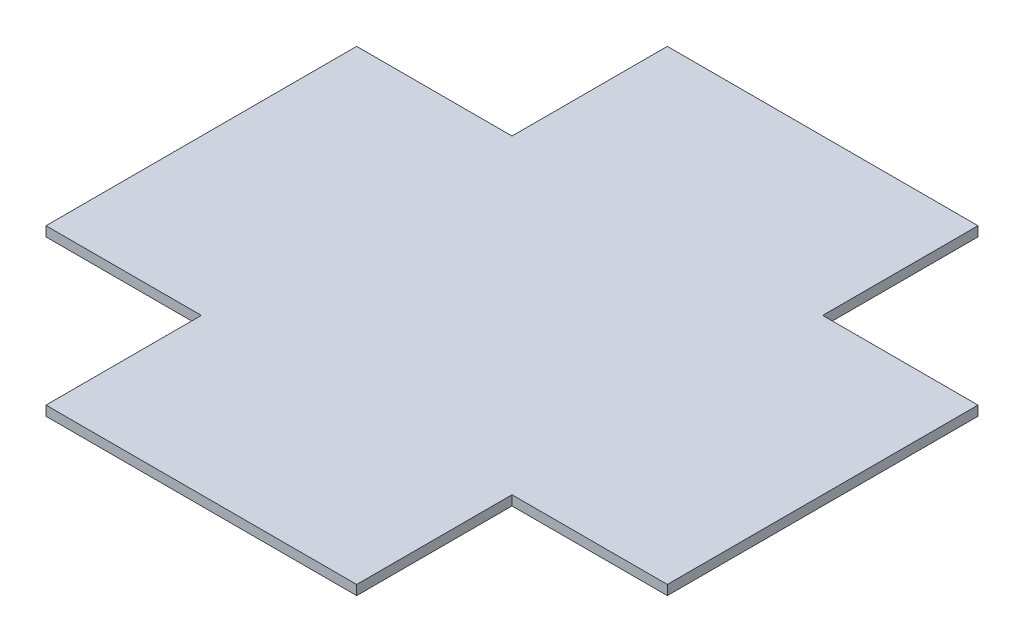
ISO-10303-21;
HEADER;
FILE_DESCRIPTION(('STEP AP214'),'2;1');
FILE_NAME('part.step','',(''),(''),'','','');
FILE_SCHEMA(('AUTOMOTIVE_DESIGN { 1 0 10303 214 1 1 1 1 }'));
ENDSEC;
DATA;
#1=APPLICATION_CONTEXT('core data for automotive mechanical design processes');
#2=APPLICATION_PROTOCOL_DEFINITION('international standard','automotive_design',2000,#1);
#3=PRODUCT_CONTEXT('',#1,'mechanical');
#4=PRODUCT('Part','Part','',(#3));
#5=PRODUCT_RELATED_PRODUCT_CATEGORY('part','',(#4));
#6=PRODUCT_DEFINITION_FORMATION('','',#4);
#7=PRODUCT_DEFINITION_CONTEXT('part definition',#1,'design');
#8=PRODUCT_DEFINITION('design','',#6,#7);
#9=PRODUCT_DEFINITION_SHAPE('','',#8);
#10=(LENGTH_UNIT() NAMED_UNIT(*) SI_UNIT(.MILLI.,.METRE.));
#11=(NAMED_UNIT(*) PLANE_ANGLE_UNIT() SI_UNIT($,.RADIAN.));
#12=(NAMED_UNIT(*) SI_UNIT($,.STERADIAN.) SOLID_ANGLE_UNIT());
#13=UNCERTAINTY_MEASURE_WITH_UNIT(LENGTH_MEASURE(1.E-05),#10,'distance_accuracy_value','');
#14=(GEOMETRIC_REPRESENTATION_CONTEXT(3) GLOBAL_UNCERTAINTY_ASSIGNED_CONTEXT((#13)) GLOBAL_UNIT_ASSIGNED_CONTEXT((#10,
#11,#12)) REPRESENTATION_CONTEXT('',''));
#15=CARTESIAN_POINT('',(0.,0.,0.));
#16=DIRECTION('',(0.,0.,1.));
#17=DIRECTION('',(1.,0.,0.));
#18=AXIS2_PLACEMENT_3D('',#15,#16,#17);
#19=CARTESIAN_POINT('',(25.4,1.5875,-50.8));
#20=DIRECTION('',(0.,0.,1.));
#21=DIRECTION('',(1.,0.,0.));
#22=AXIS2_PLACEMENT_3D('',#19,#20,#21);
#23=PLANE('',#22);
#24=DIRECTION('',(-1.,0.,0.));
#25=VECTOR('',#24,1.);
#26=CARTESIAN_POINT('',(25.4,0.,-50.8));
#27=LINE('',#26,#25);
#28=CARTESIAN_POINT('',(25.4,0.,-50.8));
#29=VERTEX_POINT('',#28);
#30=CARTESIAN_POINT('',(-25.4,0.,-50.8));
#31=VERTEX_POINT('',#30);
#32=EDGE_CURVE('E154',#29,#31,#27,.T.);
#33=ORIENTED_EDGE('',*,*,#32,.T.);
#34=DIRECTION('',(0.,-1.,0.));
#35=VECTOR('',#34,1.);
#36=CARTESIAN_POINT('',(-25.4,1.5875,-50.8));
#37=LINE('',#36,#35);
#38=CARTESIAN_POINT('',(-25.4,1.5875,-50.8));
#39=VERTEX_POINT('',#38);
#40=EDGE_CURVE('E11',#39,#31,#37,.T.);
#41=ORIENTED_EDGE('',*,*,#40,.F.);
#42=DIRECTION('',(-1.,0.,0.));
#43=VECTOR('',#42,1.);
#44=CARTESIAN_POINT('',(25.4,1.5875,-50.8));
#45=LINE('',#44,#43);
#46=CARTESIAN_POINT('',(25.4,1.5875,-50.8));
#47=VERTEX_POINT('',#46);
#48=EDGE_CURVE('E176',#47,#39,#45,.T.);
#49=ORIENTED_EDGE('',*,*,#48,.F.);
#50=DIRECTION('',(0.,-1.,0.));
#51=VECTOR('',#50,1.);
#52=CARTESIAN_POINT('',(25.4,1.5875,-50.8));
#53=LINE('',#52,#51);
#54=EDGE_CURVE('E150',#47,#29,#53,.T.);
#55=ORIENTED_EDGE('',*,*,#54,.T.);
#56=EDGE_LOOP('',(#33,#41,#49,#55));
#57=FACE_BOUND('',#56,.T.);
#58=ADVANCED_FACE('F34',(#57),#23,.F.);
#59=CARTESIAN_POINT('',(-25.4,1.5875,-50.8));
#60=DIRECTION('',(1.,0.,0.));
#61=DIRECTION('',(0.,0.,-1.));
#62=AXIS2_PLACEMENT_3D('',#59,#60,#61);
#63=PLANE('',#62);
#64=DIRECTION('',(0.,0.,1.));
#65=VECTOR('',#64,1.);
#66=CARTESIAN_POINT('',(-25.4,0.,-50.8));
#67=LINE('',#66,#65);
#68=CARTESIAN_POINT('',(-25.4,0.,-25.4));
#69=VERTEX_POINT('',#68);
#70=EDGE_CURVE('E157',#31,#69,#67,.T.);
#71=ORIENTED_EDGE('',*,*,#70,.T.);
#72=DIRECTION('',(0.,-1.,0.));
#73=VECTOR('',#72,1.);
#74=CARTESIAN_POINT('',(-25.4,1.5875,-25.4));
#75=LINE('',#74,#73);
#76=CARTESIAN_POINT('',(-25.4,1.5875,-25.4));
#77=VERTEX_POINT('',#76);
#78=EDGE_CURVE('E42',#77,#69,#75,.T.);
#79=ORIENTED_EDGE('',*,*,#78,.F.);
#80=DIRECTION('',(0.,0.,1.));
#81=VECTOR('',#80,1.);
#82=CARTESIAN_POINT('',(-25.4,1.5875,-50.8));
#83=LINE('',#82,#81);
#84=EDGE_CURVE('E105',#39,#77,#83,.T.);
#85=ORIENTED_EDGE('',*,*,#84,.F.);
#86=ORIENTED_EDGE('',*,*,#40,.T.);
#87=EDGE_LOOP('',(#71,#79,#85,#86));
#88=FACE_BOUND('',#87,.T.);
#89=ADVANCED_FACE('F254',(#88),#63,.F.);
#90=CARTESIAN_POINT('',(-25.4,1.5875,-25.4));
#91=DIRECTION('',(0.,0.,1.));
#92=DIRECTION('',(1.,0.,0.));
#93=AXIS2_PLACEMENT_3D('',#90,#91,#92);
#94=PLANE('',#93);
#95=DIRECTION('',(-1.,0.,0.));
#96=VECTOR('',#95,1.);
#97=CARTESIAN_POINT('',(-25.4,0.,-25.4));
#98=LINE('',#97,#96);
#99=CARTESIAN_POINT('',(-50.8,0.,-25.4));
#100=VERTEX_POINT('',#99);
#101=EDGE_CURVE('E159',#69,#100,#98,.T.);
#102=ORIENTED_EDGE('',*,*,#101,.T.);
#103=DIRECTION('',(0.,-1.,0.));
#104=VECTOR('',#103,1.);
#105=CARTESIAN_POINT('',(-50.8,1.5875,-25.4));
#106=LINE('',#105,#104);
#107=CARTESIAN_POINT('',(-50.8,1.5875,-25.4));
#108=VERTEX_POINT('',#107);
#109=EDGE_CURVE('E195',#108,#100,#106,.T.);
#110=ORIENTED_EDGE('',*,*,#109,.F.);
#111=DIRECTION('',(-1.,0.,0.));
#112=VECTOR('',#111,1.);
#113=CARTESIAN_POINT('',(-25.4,1.5875,-25.4));
#114=LINE('',#113,#112);
#115=EDGE_CURVE('E203',#77,#108,#114,.T.);
#116=ORIENTED_EDGE('',*,*,#115,.F.);
#117=ORIENTED_EDGE('',*,*,#78,.T.);
#118=EDGE_LOOP('',(#102,#110,#116,#117));
#119=FACE_BOUND('',#118,.T.);
#120=ADVANCED_FACE('F201',(#119),#94,.F.);
#121=CARTESIAN_POINT('',(-50.8,1.5875,-25.4));
#122=DIRECTION('',(1.,0.,0.));
#123=DIRECTION('',(0.,0.,-1.));
#124=AXIS2_PLACEMENT_3D('',#121,#122,#123);
#125=PLANE('',#124);
#126=DIRECTION('',(0.,0.,1.));
#127=VECTOR('',#126,1.);
#128=CARTESIAN_POINT('',(-50.8,0.,-25.4));
#129=LINE('',#128,#127);
#130=CARTESIAN_POINT('',(-50.8,0.,25.4));
#131=VERTEX_POINT('',#130);
#132=EDGE_CURVE('E161',#100,#131,#129,.T.);
#133=ORIENTED_EDGE('',*,*,#132,.T.);
#134=DIRECTION('',(0.,-1.,0.));
#135=VECTOR('',#134,1.);
#136=CARTESIAN_POINT('',(-50.8,1.5875,25.4));
#137=LINE('',#136,#135);
#138=CARTESIAN_POINT('',(-50.8,1.5875,25.4));
#139=VERTEX_POINT('',#138);
#140=EDGE_CURVE('E192',#139,#131,#137,.T.);
#141=ORIENTED_EDGE('',*,*,#140,.F.);
#142=DIRECTION('',(0.,0.,1.));
#143=VECTOR('',#142,1.);
#144=CARTESIAN_POINT('',(-50.8,1.5875,-25.4));
#145=LINE('',#144,#143);
#146=EDGE_CURVE('E221',#108,#139,#145,.T.);
#147=ORIENTED_EDGE('',*,*,#146,.F.);
#148=ORIENTED_EDGE('',*,*,#109,.T.);
#149=EDGE_LOOP('',(#133,#141,#147,#148));
#150=FACE_BOUND('',#149,.T.);
#151=ADVANCED_FACE('F212',(#150),#125,.F.);
#152=CARTESIAN_POINT('',(-50.8,1.5875,25.4));
#153=DIRECTION('',(0.,0.,-1.));
#154=DIRECTION('',(-1.,0.,0.));
#155=AXIS2_PLACEMENT_3D('',#152,#153,#154);
#156=PLANE('',#155);
#157=DIRECTION('',(1.,0.,0.));
#158=VECTOR('',#157,1.);
#159=CARTESIAN_POINT('',(-50.8,0.,25.4));
#160=LINE('',#159,#158);
#161=CARTESIAN_POINT('',(-25.4,0.,25.4));
#162=VERTEX_POINT('',#161);
#163=EDGE_CURVE('E163',#131,#162,#160,.T.);
#164=ORIENTED_EDGE('',*,*,#163,.T.);
#165=DIRECTION('',(0.,-1.,0.));
#166=VECTOR('',#165,1.);
#167=CARTESIAN_POINT('',(-25.4,1.5875,25.4));
#168=LINE('',#167,#166);
#169=CARTESIAN_POINT('',(-25.4,1.5875,25.4));
#170=VERTEX_POINT('',#169);
#171=EDGE_CURVE('E189',#170,#162,#168,.T.);
#172=ORIENTED_EDGE('',*,*,#171,.F.);
#173=DIRECTION('',(1.,0.,0.));
#174=VECTOR('',#173,1.);
#175=CARTESIAN_POINT('',(-50.8,1.5875,25.4));
#176=LINE('',#175,#174);
#177=EDGE_CURVE('E218',#139,#170,#176,.T.);
#178=ORIENTED_EDGE('',*,*,#177,.F.);
#179=ORIENTED_EDGE('',*,*,#140,.T.);
#180=EDGE_LOOP('',(#164,#172,#178,#179));
#181=FACE_BOUND('',#180,.T.);
#182=ADVANCED_FACE('F216',(#181),#156,.F.);
#183=CARTESIAN_POINT('',(-25.4,1.5875,25.4));
#184=DIRECTION('',(1.,0.,0.));
#185=DIRECTION('',(0.,0.,-1.));
#186=AXIS2_PLACEMENT_3D('',#183,#184,#185);
#187=PLANE('',#186);
#188=DIRECTION('',(0.,0.,1.));
#189=VECTOR('',#188,1.);
#190=CARTESIAN_POINT('',(-25.4,0.,25.4));
#191=LINE('',#190,#189);
#192=CARTESIAN_POINT('',(-25.4,0.,50.8));
#193=VERTEX_POINT('',#192);
#194=EDGE_CURVE('E165',#162,#193,#191,.T.);
#195=ORIENTED_EDGE('',*,*,#194,.T.);
#196=DIRECTION('',(0.,-1.,0.));
#197=VECTOR('',#196,1.);
#198=CARTESIAN_POINT('',(-25.4,1.5875,50.8));
#199=LINE('',#198,#197);
#200=CARTESIAN_POINT('',(-25.4,1.5875,50.8));
#201=VERTEX_POINT('',#200);
#202=EDGE_CURVE('E186',#201,#193,#199,.T.);
#203=ORIENTED_EDGE('',*,*,#202,.F.);
#204=DIRECTION('',(0.,0.,1.));
#205=VECTOR('',#204,1.);
#206=CARTESIAN_POINT('',(-25.4,1.5875,25.4));
#207=LINE('',#206,#205);
#208=EDGE_CURVE('E220',#170,#201,#207,.T.);
#209=ORIENTED_EDGE('',*,*,#208,.F.);
#210=ORIENTED_EDGE('',*,*,#171,.T.);
#211=EDGE_LOOP('',(#195,#203,#209,#210));
#212=FACE_BOUND('',#211,.T.);
#213=ADVANCED_FACE('F267',(#212),#187,.F.);
#214=CARTESIAN_POINT('',(-25.4,1.5875,50.8));
#215=DIRECTION('',(0.,0.,-1.));
#216=DIRECTION('',(-1.,0.,0.));
#217=AXIS2_PLACEMENT_3D('',#214,#215,#216);
#218=PLANE('',#217);
#219=DIRECTION('',(1.,0.,0.));
#220=VECTOR('',#219,1.);
#221=CARTESIAN_POINT('',(-25.4,0.,50.8));
#222=LINE('',#221,#220);
#223=CARTESIAN_POINT('',(25.4,0.,50.8));
#224=VERTEX_POINT('',#223);
#225=EDGE_CURVE('E167',#193,#224,#222,.T.);
#226=ORIENTED_EDGE('',*,*,#225,.T.);
#227=DIRECTION('',(0.,-1.,0.));
#228=VECTOR('',#227,1.);
#229=CARTESIAN_POINT('',(25.4,1.5875,50.8));
#230=LINE('',#229,#228);
#231=CARTESIAN_POINT('',(25.4,1.5875,50.8));
#232=VERTEX_POINT('',#231);
#233=EDGE_CURVE('E183',#232,#224,#230,.T.);
#234=ORIENTED_EDGE('',*,*,#233,.F.);
#235=DIRECTION('',(1.,0.,0.));
#236=VECTOR('',#235,1.);
#237=CARTESIAN_POINT('',(-25.4,1.5875,50.8));
#238=LINE('',#237,#236);
#239=EDGE_CURVE('E223',#201,#232,#238,.T.);
#240=ORIENTED_EDGE('',*,*,#239,.F.);
#241=ORIENTED_EDGE('',*,*,#202,.T.);
#242=EDGE_LOOP('',(#226,#234,#240,#241));
#243=FACE_BOUND('',#242,.T.);
#244=ADVANCED_FACE('F270',(#243),#218,.F.);
#245=CARTESIAN_POINT('',(25.4,1.5875,50.8));
#246=DIRECTION('',(-1.,0.,0.));
#247=DIRECTION('',(0.,0.,1.));
#248=AXIS2_PLACEMENT_3D('',#245,#246,#247);
#249=PLANE('',#248);
#250=DIRECTION('',(0.,0.,-1.));
#251=VECTOR('',#250,1.);
#252=CARTESIAN_POINT('',(25.4,0.,50.8));
#253=LINE('',#252,#251);
#254=CARTESIAN_POINT('',(25.4,0.,25.4));
#255=VERTEX_POINT('',#254);
#256=EDGE_CURVE('E169',#224,#255,#253,.T.);
#257=ORIENTED_EDGE('',*,*,#256,.T.);
#258=DIRECTION('',(0.,-1.,0.));
#259=VECTOR('',#258,1.);
#260=CARTESIAN_POINT('',(25.4,1.5875,25.4));
#261=LINE('',#260,#259);
#262=CARTESIAN_POINT('',(25.4,1.5875,25.4));
#263=VERTEX_POINT('',#262);
#264=EDGE_CURVE('E180',#263,#255,#261,.T.);
#265=ORIENTED_EDGE('',*,*,#264,.F.);
#266=DIRECTION('',(0.,0.,-1.));
#267=VECTOR('',#266,1.);
#268=CARTESIAN_POINT('',(25.4,1.5875,50.8));
#269=LINE('',#268,#267);
#270=EDGE_CURVE('E229',#232,#263,#269,.T.);
#271=ORIENTED_EDGE('',*,*,#270,.F.);
#272=ORIENTED_EDGE('',*,*,#233,.T.);
#273=EDGE_LOOP('',(#257,#265,#271,#272));
#274=FACE_BOUND('',#273,.T.);
#275=ADVANCED_FACE('F235',(#274),#249,.F.);
#276=CARTESIAN_POINT('',(25.4,1.5875,25.4));
#277=DIRECTION('',(0.,0.,-1.));
#278=DIRECTION('',(-1.,0.,0.));
#279=AXIS2_PLACEMENT_3D('',#276,#277,#278);
#280=PLANE('',#279);
#281=DIRECTION('',(1.,0.,0.));
#282=VECTOR('',#281,1.);
#283=CARTESIAN_POINT('',(25.4,0.,25.4));
#284=LINE('',#283,#282);
#285=CARTESIAN_POINT('',(50.8,0.,25.4));
#286=VERTEX_POINT('',#285);
#287=EDGE_CURVE('E171',#255,#286,#284,.T.);
#288=ORIENTED_EDGE('',*,*,#287,.T.);
#289=DIRECTION('',(0.,-1.,0.));
#290=VECTOR('',#289,1.);
#291=CARTESIAN_POINT('',(50.8,1.5875,25.4));
#292=LINE('',#291,#290);
#293=CARTESIAN_POINT('',(50.8,1.5875,25.4));
#294=VERTEX_POINT('',#293);
#295=EDGE_CURVE('E145',#294,#286,#292,.T.);
#296=ORIENTED_EDGE('',*,*,#295,.F.);
#297=DIRECTION('',(1.,0.,0.));
#298=VECTOR('',#297,1.);
#299=CARTESIAN_POINT('',(25.4,1.5875,25.4));
#300=LINE('',#299,#298);
#301=EDGE_CURVE('E136',#263,#294,#300,.T.);
#302=ORIENTED_EDGE('',*,*,#301,.F.);
#303=ORIENTED_EDGE('',*,*,#264,.T.);
#304=EDGE_LOOP('',(#288,#296,#302,#303));
#305=FACE_BOUND('',#304,.T.);
#306=ADVANCED_FACE('F239',(#305),#280,.F.);
#307=CARTESIAN_POINT('',(50.8,1.5875,25.4));
#308=DIRECTION('',(-1.,0.,0.));
#309=DIRECTION('',(0.,0.,1.));
#310=AXIS2_PLACEMENT_3D('',#307,#308,#309);
#311=PLANE('',#310);
#312=DIRECTION('',(0.,0.,-1.));
#313=VECTOR('',#312,1.);
#314=CARTESIAN_POINT('',(50.8,0.,25.4));
#315=LINE('',#314,#313);
#316=CARTESIAN_POINT('',(50.8,0.,-25.4));
#317=VERTEX_POINT('',#316);
#318=EDGE_CURVE('E144',#286,#317,#315,.T.);
#319=ORIENTED_EDGE('',*,*,#318,.T.);
#320=DIRECTION('',(0.,-1.,0.));
#321=VECTOR('',#320,1.);
#322=CARTESIAN_POINT('',(50.8,1.5875,-25.4));
#323=LINE('',#322,#321);
#324=CARTESIAN_POINT('',(50.8,1.5875,-25.4));
#325=VERTEX_POINT('',#324);
#326=EDGE_CURVE('E141',#325,#317,#323,.T.);
#327=ORIENTED_EDGE('',*,*,#326,.F.);
#328=DIRECTION('',(0.,0.,-1.));
#329=VECTOR('',#328,1.);
#330=CARTESIAN_POINT('',(50.8,1.5875,25.4));
#331=LINE('',#330,#329);
#332=EDGE_CURVE('E130',#294,#325,#331,.T.);
#333=ORIENTED_EDGE('',*,*,#332,.F.);
#334=ORIENTED_EDGE('',*,*,#295,.T.);
#335=EDGE_LOOP('',(#319,#327,#333,#334));
#336=FACE_BOUND('',#335,.T.);
#337=ADVANCED_FACE('F142',(#336),#311,.F.);
#338=CARTESIAN_POINT('',(50.8,1.5875,-25.4));
#339=DIRECTION('',(0.,0.,1.));
#340=DIRECTION('',(1.,0.,0.));
#341=AXIS2_PLACEMENT_3D('',#338,#339,#340);
#342=PLANE('',#341);
#343=DIRECTION('',(-1.,0.,0.));
#344=VECTOR('',#343,1.);
#345=CARTESIAN_POINT('',(50.8,0.,-25.4));
#346=LINE('',#345,#344);
#347=CARTESIAN_POINT('',(25.4,0.,-25.4));
#348=VERTEX_POINT('',#347);
#349=EDGE_CURVE('E91',#317,#348,#346,.T.);
#350=ORIENTED_EDGE('',*,*,#349,.T.);
#351=DIRECTION('',(0.,-1.,0.));
#352=VECTOR('',#351,1.);
#353=CARTESIAN_POINT('',(25.4,1.5875,-25.4));
#354=LINE('',#353,#352);
#355=CARTESIAN_POINT('',(25.4,1.5875,-25.4));
#356=VERTEX_POINT('',#355);
#357=EDGE_CURVE('E146',#356,#348,#354,.T.);
#358=ORIENTED_EDGE('',*,*,#357,.F.);
#359=DIRECTION('',(-1.,0.,0.));
#360=VECTOR('',#359,1.);
#361=CARTESIAN_POINT('',(50.8,1.5875,-25.4));
#362=LINE('',#361,#360);
#363=EDGE_CURVE('E134',#325,#356,#362,.T.);
#364=ORIENTED_EDGE('',*,*,#363,.F.);
#365=ORIENTED_EDGE('',*,*,#326,.T.);
#366=EDGE_LOOP('',(#350,#358,#364,#365));
#367=FACE_BOUND('',#366,.T.);
#368=ADVANCED_FACE('F148',(#367),#342,.F.);
#369=CARTESIAN_POINT('',(25.4,1.5875,-25.4));
#370=DIRECTION('',(-1.,0.,0.));
#371=DIRECTION('',(0.,0.,1.));
#372=AXIS2_PLACEMENT_3D('',#369,#370,#371);
#373=PLANE('',#372);
#374=DIRECTION('',(0.,0.,-1.));
#375=VECTOR('',#374,1.);
#376=CARTESIAN_POINT('',(25.4,0.,-25.4));
#377=LINE('',#376,#375);
#378=EDGE_CURVE('E97',#348,#29,#377,.T.);
#379=ORIENTED_EDGE('',*,*,#378,.T.);
#380=ORIENTED_EDGE('',*,*,#54,.F.);
#381=DIRECTION('',(0.,0.,-1.));
#382=VECTOR('',#381,1.);
#383=CARTESIAN_POINT('',(25.4,1.5875,-25.4));
#384=LINE('',#383,#382);
#385=EDGE_CURVE('E50',#356,#47,#384,.T.);
#386=ORIENTED_EDGE('',*,*,#385,.F.);
#387=ORIENTED_EDGE('',*,*,#357,.T.);
#388=EDGE_LOOP('',(#379,#380,#386,#387));
#389=FACE_BOUND('',#388,.T.);
#390=ADVANCED_FACE('F243',(#389),#373,.F.);
#391=CARTESIAN_POINT('',(0.,1.5875,0.));
#392=DIRECTION('',(0.,1.,0.));
#393=DIRECTION('',(0.,0.,1.));
#394=AXIS2_PLACEMENT_3D('',#391,#392,#393);
#395=PLANE('',#394);
#396=ORIENTED_EDGE('',*,*,#48,.T.);
#397=ORIENTED_EDGE('',*,*,#84,.T.);
#398=ORIENTED_EDGE('',*,*,#115,.T.);
#399=ORIENTED_EDGE('',*,*,#146,.T.);
#400=ORIENTED_EDGE('',*,*,#177,.T.);
#401=ORIENTED_EDGE('',*,*,#208,.T.);
#402=ORIENTED_EDGE('',*,*,#239,.T.);
#403=ORIENTED_EDGE('',*,*,#270,.T.);
#404=ORIENTED_EDGE('',*,*,#301,.T.);
#405=ORIENTED_EDGE('',*,*,#332,.T.);
#406=ORIENTED_EDGE('',*,*,#363,.T.);
#407=ORIENTED_EDGE('',*,*,#385,.T.);
#408=EDGE_LOOP('',(#396,#397,#398,#399,#400,#401,#402,#403,#404,#405,#406,#407));
#409=FACE_BOUND('',#408,.T.);
#410=ADVANCED_FACE('F132',(#409),#395,.T.);
#411=CARTESIAN_POINT('',(0.,0.,0.));
#412=DIRECTION('',(0.,1.,0.));
#413=DIRECTION('',(0.,0.,1.));
#414=AXIS2_PLACEMENT_3D('',#411,#412,#413);
#415=PLANE('',#414);
#416=ORIENTED_EDGE('',*,*,#32,.F.);
#417=ORIENTED_EDGE('',*,*,#378,.F.);
#418=ORIENTED_EDGE('',*,*,#349,.F.);
#419=ORIENTED_EDGE('',*,*,#318,.F.);
#420=ORIENTED_EDGE('',*,*,#287,.F.);
#421=ORIENTED_EDGE('',*,*,#256,.F.);
#422=ORIENTED_EDGE('',*,*,#225,.F.);
#423=ORIENTED_EDGE('',*,*,#194,.F.);
#424=ORIENTED_EDGE('',*,*,#163,.F.);
#425=ORIENTED_EDGE('',*,*,#132,.F.);
#426=ORIENTED_EDGE('',*,*,#101,.F.);
#427=ORIENTED_EDGE('',*,*,#70,.F.);
#428=EDGE_LOOP('',(#416,#417,#418,#419,#420,#421,#422,#423,#424,#425,#426,#427));
#429=FACE_BOUND('',#428,.T.);
#430=ADVANCED_FACE('F207',(#429),#415,.F.);
#431=CLOSED_SHELL('',(#58,#89,#120,#151,#182,#213,#244,#275,#306,#337,#368,#390,#410,#430));
#432=MANIFOLD_SOLID_BREP('B2',#431);
#433=ADVANCED_BREP_SHAPE_REPRESENTATION('',(#18,#432),#14);
#434=SHAPE_DEFINITION_REPRESENTATION(#9,#433);
ENDSEC;
END-ISO-10303-21;
